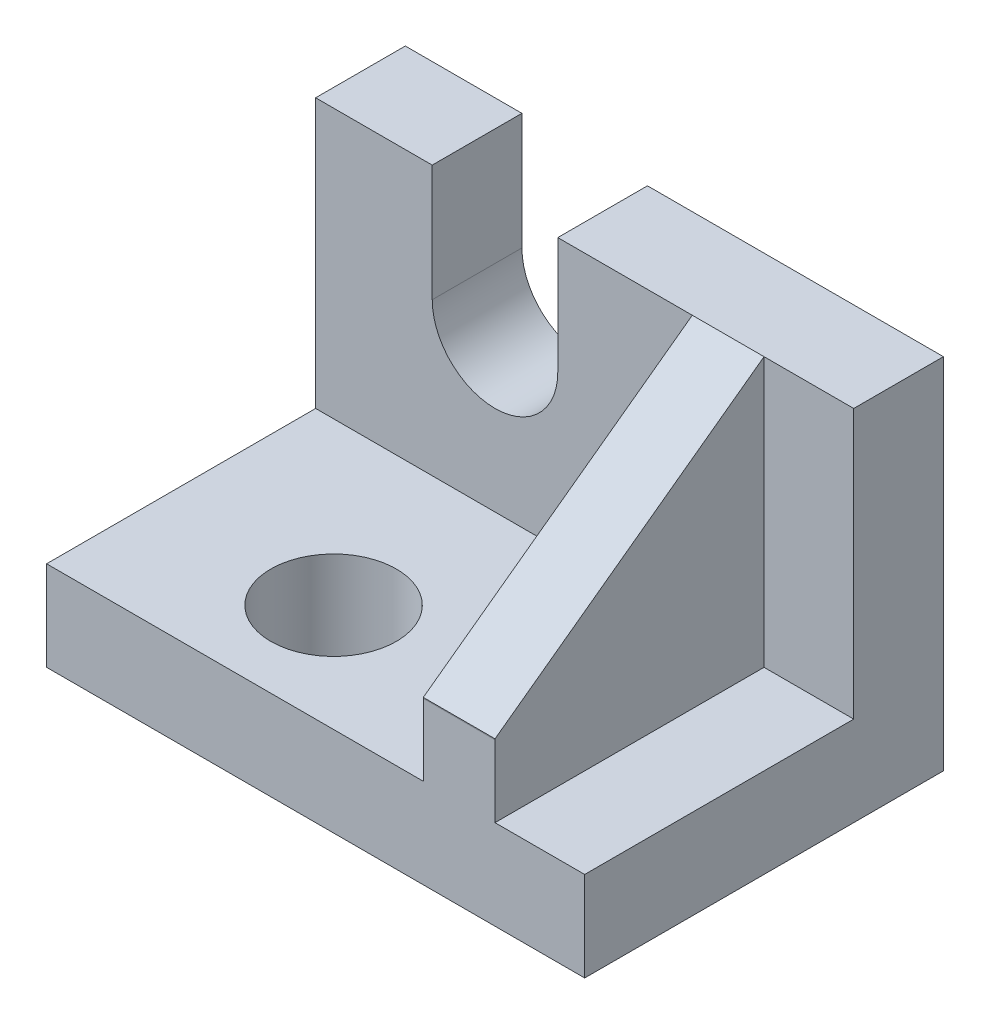
ISO-10303-21;
HEADER;
FILE_DESCRIPTION(('STEP AP214'),'2;1');
FILE_NAME('part.step','',(''),(''),'','','');
FILE_SCHEMA(('AUTOMOTIVE_DESIGN { 1 0 10303 214 1 1 1 1 }'));
ENDSEC;
DATA;
#1=APPLICATION_CONTEXT('core data for automotive mechanical design processes');
#2=APPLICATION_PROTOCOL_DEFINITION('international standard','automotive_design',2000,#1);
#3=PRODUCT_CONTEXT('',#1,'mechanical');
#4=PRODUCT('Part','Part','',(#3));
#5=PRODUCT_RELATED_PRODUCT_CATEGORY('part','',(#4));
#6=PRODUCT_DEFINITION_FORMATION('','',#4);
#7=PRODUCT_DEFINITION_CONTEXT('part definition',#1,'design');
#8=PRODUCT_DEFINITION('design','',#6,#7);
#9=PRODUCT_DEFINITION_SHAPE('','',#8);
#10=(LENGTH_UNIT() NAMED_UNIT(*) SI_UNIT(.MILLI.,.METRE.));
#11=(NAMED_UNIT(*) PLANE_ANGLE_UNIT() SI_UNIT($,.RADIAN.));
#12=(NAMED_UNIT(*) SI_UNIT($,.STERADIAN.) SOLID_ANGLE_UNIT());
#13=UNCERTAINTY_MEASURE_WITH_UNIT(LENGTH_MEASURE(1.E-05),#10,'distance_accuracy_value','');
#14=(GEOMETRIC_REPRESENTATION_CONTEXT(3) GLOBAL_UNCERTAINTY_ASSIGNED_CONTEXT((#13)) GLOBAL_UNIT_ASSIGNED_CONTEXT((#10,
#11,#12)) REPRESENTATION_CONTEXT('',''));
#15=CARTESIAN_POINT('',(0.,0.,0.));
#16=DIRECTION('',(0.,0.,1.));
#17=DIRECTION('',(1.,0.,0.));
#18=AXIS2_PLACEMENT_3D('',#15,#16,#17);
#19=CARTESIAN_POINT('',(0.,40.,0.));
#20=DIRECTION('',(0.,-1.,0.));
#21=DIRECTION('',(0.,0.,-1.));
#22=AXIS2_PLACEMENT_3D('',#19,#20,#21);
#23=PLANE('',#22);
#24=DIRECTION('',(0.,0.,1.));
#25=VECTOR('',#24,1.);
#26=CARTESIAN_POINT('',(-18.,40.,9.9999));
#27=LINE('',#26,#25);
#28=CARTESIAN_POINT('',(-18.,40.,9.9999));
#29=VERTEX_POINT('',#28);
#30=CARTESIAN_POINT('',(-18.,40.,10.));
#31=VERTEX_POINT('',#30);
#32=EDGE_CURVE('E226',#29,#31,#27,.T.);
#33=ORIENTED_EDGE('',*,*,#32,.T.);
#34=DIRECTION('',(1.,0.,0.));
#35=VECTOR('',#34,1.);
#36=CARTESIAN_POINT('',(-34.,40.,10.));
#37=LINE('',#36,#35);
#38=CARTESIAN_POINT('',(-9.99999999999999,40.,10.));
#39=VERTEX_POINT('',#38);
#40=EDGE_CURVE('E147',#31,#39,#37,.T.);
#41=ORIENTED_EDGE('',*,*,#40,.T.);
#42=DIRECTION('',(-1.,0.,0.));
#43=VECTOR('',#42,1.);
#44=CARTESIAN_POINT('',(0.,40.,10.));
#45=LINE('',#44,#43);
#46=CARTESIAN_POINT('',(0.,40.,10.));
#47=VERTEX_POINT('',#46);
#48=EDGE_CURVE('E192',#47,#39,#45,.T.);
#49=ORIENTED_EDGE('',*,*,#48,.F.);
#50=DIRECTION('',(0.,0.,-1.));
#51=VECTOR('',#50,1.);
#52=CARTESIAN_POINT('',(0.,40.,0.));
#53=LINE('',#52,#51);
#54=CARTESIAN_POINT('',(0.,40.,0.));
#55=VERTEX_POINT('',#54);
#56=EDGE_CURVE('E230',#47,#55,#53,.T.);
#57=ORIENTED_EDGE('',*,*,#56,.T.);
#58=DIRECTION('',(-1.,0.,0.));
#59=VECTOR('',#58,1.);
#60=CARTESIAN_POINT('',(0.,40.,0.));
#61=LINE('',#60,#59);
#62=CARTESIAN_POINT('',(-33.,40.,0.));
#63=VERTEX_POINT('',#62);
#64=EDGE_CURVE('E234',#55,#63,#61,.T.);
#65=ORIENTED_EDGE('',*,*,#64,.T.);
#66=DIRECTION('',(0.,0.,1.));
#67=VECTOR('',#66,1.);
#68=CARTESIAN_POINT('',(-33.,40.,-24.));
#69=LINE('',#68,#67);
#70=CARTESIAN_POINT('',(-33.,40.,9.9999));
#71=VERTEX_POINT('',#70);
#72=EDGE_CURVE('E175',#63,#71,#69,.T.);
#73=ORIENTED_EDGE('',*,*,#72,.T.);
#74=DIRECTION('',(1.,0.,0.));
#75=VECTOR('',#74,1.);
#76=CARTESIAN_POINT('',(-33.,40.,9.9999));
#77=LINE('',#76,#75);
#78=EDGE_CURVE('E204',#71,#29,#77,.T.);
#79=ORIENTED_EDGE('',*,*,#78,.T.);
#80=EDGE_LOOP('',(#33,#41,#49,#57,#65,#73,#79));
#81=FACE_BOUND('',#80,.T.);
#82=ADVANCED_FACE('F35',(#81),#23,.F.);
#83=DIRECTION('',(1.,0.,0.));
#84=VECTOR('',#83,1.);
#85=CARTESIAN_POINT('',(-60.,40.,9.9999));
#86=LINE('',#85,#84);
#87=CARTESIAN_POINT('',(-60.,40.,9.9999));
#88=VERTEX_POINT('',#87);
#89=CARTESIAN_POINT('',(-47.,40.,9.9999));
#90=VERTEX_POINT('',#89);
#91=EDGE_CURVE('E214',#88,#90,#86,.T.);
#92=ORIENTED_EDGE('',*,*,#91,.T.);
#93=DIRECTION('',(0.,0.,1.));
#94=VECTOR('',#93,1.);
#95=CARTESIAN_POINT('',(-47.,40.,-24.));
#96=LINE('',#95,#94);
#97=CARTESIAN_POINT('',(-47.,40.,0.));
#98=VERTEX_POINT('',#97);
#99=EDGE_CURVE('E174',#98,#90,#96,.T.);
#100=ORIENTED_EDGE('',*,*,#99,.F.);
#101=CARTESIAN_POINT('',(-60.,40.,0.));
#102=VERTEX_POINT('',#101);
#103=EDGE_CURVE('E232',#98,#102,#61,.T.);
#104=ORIENTED_EDGE('',*,*,#103,.T.);
#105=DIRECTION('',(0.,0.,1.));
#106=VECTOR('',#105,1.);
#107=CARTESIAN_POINT('',(-60.,40.,0.));
#108=LINE('',#107,#106);
#109=EDGE_CURVE('E237',#102,#88,#108,.T.);
#110=ORIENTED_EDGE('',*,*,#109,.T.);
#111=EDGE_LOOP('',(#92,#100,#104,#110));
#112=FACE_BOUND('',#111,.T.);
#113=ADVANCED_FACE('F314',(#112),#23,.F.);
#114=CARTESIAN_POINT('',(0.,40.,40.));
#115=DIRECTION('',(0.,0.,-1.));
#116=DIRECTION('',(-1.,0.,0.));
#117=AXIS2_PLACEMENT_3D('',#114,#115,#116);
#118=PLANE('',#117);
#119=DIRECTION('',(0.,-1.,0.));
#120=VECTOR('',#119,1.);
#121=CARTESIAN_POINT('',(-9.99999999999999,40.,40.));
#122=LINE('',#121,#120);
#123=CARTESIAN_POINT('',(-9.99999999999999,18.,40.));
#124=VERTEX_POINT('',#123);
#125=CARTESIAN_POINT('',(-9.99999999999999,10.,40.));
#126=VERTEX_POINT('',#125);
#127=EDGE_CURVE('E202',#124,#126,#122,.T.);
#128=ORIENTED_EDGE('',*,*,#127,.F.);
#129=DIRECTION('',(1.,0.,0.));
#130=VECTOR('',#129,1.);
#131=CARTESIAN_POINT('',(-34.,18.,40.));
#132=LINE('',#131,#130);
#133=CARTESIAN_POINT('',(-18.,18.,40.));
#134=VERTEX_POINT('',#133);
#135=EDGE_CURVE('E276',#134,#124,#132,.T.);
#136=ORIENTED_EDGE('',*,*,#135,.F.);
#137=DIRECTION('',(0.,1.,0.));
#138=VECTOR('',#137,1.);
#139=CARTESIAN_POINT('',(-18.,40.,40.));
#140=LINE('',#139,#138);
#141=CARTESIAN_POINT('',(-18.,10.,40.));
#142=VERTEX_POINT('',#141);
#143=EDGE_CURVE('E164',#142,#134,#140,.T.);
#144=ORIENTED_EDGE('',*,*,#143,.F.);
#145=DIRECTION('',(1.,0.,0.));
#146=VECTOR('',#145,1.);
#147=CARTESIAN_POINT('',(0.,10.,40.));
#148=LINE('',#147,#146);
#149=CARTESIAN_POINT('',(-60.,10.,40.));
#150=VERTEX_POINT('',#149);
#151=EDGE_CURVE('E259',#150,#142,#148,.T.);
#152=ORIENTED_EDGE('',*,*,#151,.F.);
#153=DIRECTION('',(0.,-1.,0.));
#154=VECTOR('',#153,1.);
#155=CARTESIAN_POINT('',(-60.,40.,40.));
#156=LINE('',#155,#154);
#157=CARTESIAN_POINT('',(-60.,0.,40.));
#158=VERTEX_POINT('',#157);
#159=EDGE_CURVE('E251',#150,#158,#156,.T.);
#160=ORIENTED_EDGE('',*,*,#159,.T.);
#161=DIRECTION('',(1.,0.,0.));
#162=VECTOR('',#161,1.);
#163=CARTESIAN_POINT('',(0.,0.,40.));
#164=LINE('',#163,#162);
#165=CARTESIAN_POINT('',(0.,0.,40.));
#166=VERTEX_POINT('',#165);
#167=EDGE_CURVE('E233',#158,#166,#164,.T.);
#168=ORIENTED_EDGE('',*,*,#167,.T.);
#169=DIRECTION('',(0.,-1.,0.));
#170=VECTOR('',#169,1.);
#171=CARTESIAN_POINT('',(0.,40.,40.));
#172=LINE('',#171,#170);
#173=CARTESIAN_POINT('',(0.,10.,40.));
#174=VERTEX_POINT('',#173);
#175=EDGE_CURVE('E240',#174,#166,#172,.T.);
#176=ORIENTED_EDGE('',*,*,#175,.F.);
#177=DIRECTION('',(1.,0.,0.));
#178=VECTOR('',#177,1.);
#179=CARTESIAN_POINT('',(0.,10.,40.));
#180=LINE('',#179,#178);
#181=EDGE_CURVE('E200',#126,#174,#180,.T.);
#182=ORIENTED_EDGE('',*,*,#181,.F.);
#183=EDGE_LOOP('',(#128,#136,#144,#152,#160,#168,#176,#182));
#184=FACE_BOUND('',#183,.T.);
#185=ADVANCED_FACE('F284',(#184),#118,.F.);
#186=CARTESIAN_POINT('',(0.,40.,0.));
#187=DIRECTION('',(-1.,0.,0.));
#188=DIRECTION('',(0.,0.,1.));
#189=AXIS2_PLACEMENT_3D('',#186,#187,#188);
#190=PLANE('',#189);
#191=DIRECTION('',(0.,0.,-1.));
#192=VECTOR('',#191,1.);
#193=CARTESIAN_POINT('',(0.,10.,0.));
#194=LINE('',#193,#192);
#195=CARTESIAN_POINT('',(0.,10.,10.));
#196=VERTEX_POINT('',#195);
#197=EDGE_CURVE('E44',#174,#196,#194,.T.);
#198=ORIENTED_EDGE('',*,*,#197,.F.);
#199=ORIENTED_EDGE('',*,*,#175,.T.);
#200=DIRECTION('',(0.,0.,-1.));
#201=VECTOR('',#200,1.);
#202=CARTESIAN_POINT('',(0.,0.,0.));
#203=LINE('',#202,#201);
#204=CARTESIAN_POINT('',(0.,0.,0.));
#205=VERTEX_POINT('',#204);
#206=EDGE_CURVE('E229',#166,#205,#203,.T.);
#207=ORIENTED_EDGE('',*,*,#206,.T.);
#208=DIRECTION('',(0.,-1.,0.));
#209=VECTOR('',#208,1.);
#210=CARTESIAN_POINT('',(0.,40.,0.));
#211=LINE('',#210,#209);
#212=EDGE_CURVE('E256',#55,#205,#211,.T.);
#213=ORIENTED_EDGE('',*,*,#212,.F.);
#214=ORIENTED_EDGE('',*,*,#56,.F.);
#215=DIRECTION('',(0.,1.,0.));
#216=VECTOR('',#215,1.);
#217=CARTESIAN_POINT('',(0.,10.,10.));
#218=LINE('',#217,#216);
#219=EDGE_CURVE('E190',#196,#47,#218,.T.);
#220=ORIENTED_EDGE('',*,*,#219,.F.);
#221=EDGE_LOOP('',(#198,#199,#207,#213,#214,#220));
#222=FACE_BOUND('',#221,.T.);
#223=ADVANCED_FACE('F37',(#222),#190,.F.);
#224=CARTESIAN_POINT('',(-60.,40.,0.));
#225=DIRECTION('',(1.,0.,0.));
#226=DIRECTION('',(0.,0.,-1.));
#227=AXIS2_PLACEMENT_3D('',#224,#225,#226);
#228=PLANE('',#227);
#229=DIRECTION('',(0.,0.,1.));
#230=VECTOR('',#229,1.);
#231=CARTESIAN_POINT('',(-60.,10.,9.9999));
#232=LINE('',#231,#230);
#233=CARTESIAN_POINT('',(-60.,10.,9.9999));
#234=VERTEX_POINT('',#233);
#235=EDGE_CURVE('E222',#234,#150,#232,.T.);
#236=ORIENTED_EDGE('',*,*,#235,.F.);
#237=DIRECTION('',(0.,1.,0.));
#238=VECTOR('',#237,1.);
#239=CARTESIAN_POINT('',(-60.,10.,9.9999));
#240=LINE('',#239,#238);
#241=EDGE_CURVE('E211',#234,#88,#240,.T.);
#242=ORIENTED_EDGE('',*,*,#241,.T.);
#243=ORIENTED_EDGE('',*,*,#109,.F.);
#244=DIRECTION('',(0.,-1.,0.));
#245=VECTOR('',#244,1.);
#246=CARTESIAN_POINT('',(-60.,40.,0.));
#247=LINE('',#246,#245);
#248=CARTESIAN_POINT('',(-60.,0.,0.));
#249=VERTEX_POINT('',#248);
#250=EDGE_CURVE('E253',#102,#249,#247,.T.);
#251=ORIENTED_EDGE('',*,*,#250,.T.);
#252=DIRECTION('',(0.,0.,1.));
#253=VECTOR('',#252,1.);
#254=CARTESIAN_POINT('',(-60.,0.,0.));
#255=LINE('',#254,#253);
#256=EDGE_CURVE('E245',#249,#158,#255,.T.);
#257=ORIENTED_EDGE('',*,*,#256,.T.);
#258=ORIENTED_EDGE('',*,*,#159,.F.);
#259=EDGE_LOOP('',(#236,#242,#243,#251,#257,#258));
#260=FACE_BOUND('',#259,.T.);
#261=ADVANCED_FACE('F309',(#260),#228,.F.);
#262=CARTESIAN_POINT('',(0.,40.,0.));
#263=DIRECTION('',(0.,0.,1.));
#264=DIRECTION('',(1.,0.,0.));
#265=AXIS2_PLACEMENT_3D('',#262,#263,#264);
#266=PLANE('',#265);
#267=DIRECTION('',(0.,-1.,0.));
#268=VECTOR('',#267,1.);
#269=CARTESIAN_POINT('',(-47.,40.,0.));
#270=LINE('',#269,#268);
#271=CARTESIAN_POINT('',(-47.,27.,0.));
#272=VERTEX_POINT('',#271);
#273=EDGE_CURVE('E178',#98,#272,#270,.T.);
#274=ORIENTED_EDGE('',*,*,#273,.T.);
#275=CARTESIAN_POINT('',(-40.,27.,0.));
#276=DIRECTION('',(0.,0.,1.));
#277=DIRECTION('',(1.,0.,0.));
#278=AXIS2_PLACEMENT_3D('',#275,#276,#277);
#279=CIRCLE('',#278,7.);
#280=CARTESIAN_POINT('',(-33.,27.,0.));
#281=VERTEX_POINT('',#280);
#282=EDGE_CURVE('E168',#272,#281,#279,.T.);
#283=ORIENTED_EDGE('',*,*,#282,.T.);
#284=DIRECTION('',(0.,1.,0.));
#285=VECTOR('',#284,1.);
#286=CARTESIAN_POINT('',(-33.,40.,0.));
#287=LINE('',#286,#285);
#288=EDGE_CURVE('E187',#281,#63,#287,.T.);
#289=ORIENTED_EDGE('',*,*,#288,.T.);
#290=ORIENTED_EDGE('',*,*,#64,.F.);
#291=ORIENTED_EDGE('',*,*,#212,.T.);
#292=DIRECTION('',(-1.,0.,0.));
#293=VECTOR('',#292,1.);
#294=CARTESIAN_POINT('',(0.,0.,0.));
#295=LINE('',#294,#293);
#296=EDGE_CURVE('E243',#205,#249,#295,.T.);
#297=ORIENTED_EDGE('',*,*,#296,.T.);
#298=ORIENTED_EDGE('',*,*,#250,.F.);
#299=ORIENTED_EDGE('',*,*,#103,.F.);
#300=EDGE_LOOP('',(#274,#283,#289,#290,#291,#297,#298,#299));
#301=FACE_BOUND('',#300,.T.);
#302=ADVANCED_FACE('F292',(#301),#266,.F.);
#303=CARTESIAN_POINT('',(0.,0.,0.));
#304=DIRECTION('',(0.,-1.,0.));
#305=DIRECTION('',(0.,0.,-1.));
#306=AXIS2_PLACEMENT_3D('',#303,#304,#305);
#307=PLANE('',#306);
#308=CARTESIAN_POINT('',(-40.,0.,28.));
#309=DIRECTION('',(0.,1.,0.));
#310=DIRECTION('',(0.,0.,1.));
#311=AXIS2_PLACEMENT_3D('',#308,#309,#310);
#312=CIRCLE('',#311,7.);
#313=CARTESIAN_POINT('',(-40.,0.,35.));
#314=VERTEX_POINT('',#313);
#315=EDGE_CURVE('E480',#314,#314,#312,.T.);
#316=ORIENTED_EDGE('',*,*,#315,.T.);
#317=EDGE_LOOP('',(#316));
#318=FACE_BOUND('',#317,.T.);
#319=ORIENTED_EDGE('',*,*,#206,.F.);
#320=ORIENTED_EDGE('',*,*,#167,.F.);
#321=ORIENTED_EDGE('',*,*,#256,.F.);
#322=ORIENTED_EDGE('',*,*,#296,.F.);
#323=EDGE_LOOP('',(#319,#320,#321,#322));
#324=FACE_BOUND('',#323,.T.);
#325=ADVANCED_FACE('F288',(#318,#324),#307,.T.);
#326=CARTESIAN_POINT('',(-18.,10.,9.9999));
#327=DIRECTION('',(0.,1.,0.));
#328=DIRECTION('',(0.,0.,1.));
#329=AXIS2_PLACEMENT_3D('',#326,#327,#328);
#330=PLANE('',#329);
#331=CARTESIAN_POINT('',(-40.,10.,28.));
#332=DIRECTION('',(0.,1.,0.));
#333=DIRECTION('',(0.,0.,1.));
#334=AXIS2_PLACEMENT_3D('',#331,#332,#333);
#335=CIRCLE('',#334,7.);
#336=CARTESIAN_POINT('',(-40.,10.,35.));
#337=VERTEX_POINT('',#336);
#338=EDGE_CURVE('E39',#337,#337,#335,.F.);
#339=ORIENTED_EDGE('',*,*,#338,.T.);
#340=EDGE_LOOP('',(#339));
#341=FACE_BOUND('',#340,.T.);
#342=ORIENTED_EDGE('',*,*,#151,.T.);
#343=DIRECTION('',(0.,0.,1.));
#344=VECTOR('',#343,1.);
#345=CARTESIAN_POINT('',(-18.,10.,9.9999));
#346=LINE('',#345,#344);
#347=CARTESIAN_POINT('',(-18.,10.,9.9999));
#348=VERTEX_POINT('',#347);
#349=EDGE_CURVE('E224',#348,#142,#346,.T.);
#350=ORIENTED_EDGE('',*,*,#349,.F.);
#351=DIRECTION('',(-1.,0.,0.));
#352=VECTOR('',#351,1.);
#353=CARTESIAN_POINT('',(-18.,10.,9.9999));
#354=LINE('',#353,#352);
#355=EDGE_CURVE('E209',#348,#234,#354,.T.);
#356=ORIENTED_EDGE('',*,*,#355,.T.);
#357=ORIENTED_EDGE('',*,*,#235,.T.);
#358=EDGE_LOOP('',(#342,#350,#356,#357));
#359=FACE_BOUND('',#358,.T.);
#360=ADVANCED_FACE('F304',(#341,#359),#330,.T.);
#361=CARTESIAN_POINT('',(-18.,40.,9.9999));
#362=DIRECTION('',(-1.,0.,0.));
#363=DIRECTION('',(0.,0.,1.));
#364=AXIS2_PLACEMENT_3D('',#361,#362,#363);
#365=PLANE('',#364);
#366=DIRECTION('',(0.,-0.999790885462355,0.0204495805922869));
#367=VECTOR('',#366,1.);
#368=CARTESIAN_POINT('',(-18.,40.6041610955405,39.5376577034602));
#369=LINE('',#368,#367);
#370=CARTESIAN_POINT('',(-18.,18.0983508013881,39.9979883466948));
#371=VERTEX_POINT('',#370);
#372=EDGE_CURVE('E151',#371,#134,#369,.T.);
#373=ORIENTED_EDGE('',*,*,#372,.F.);
#374=DIRECTION('',(0.,-0.589666260352129,0.807647015349116));
#375=VECTOR('',#374,1.);
#376=CARTESIAN_POINT('',(-18.,40.0000476242195,9.99993477062986));
#377=LINE('',#376,#375);
#378=EDGE_CURVE('E144',#31,#371,#377,.T.);
#379=ORIENTED_EDGE('',*,*,#378,.F.);
#380=ORIENTED_EDGE('',*,*,#32,.F.);
#381=DIRECTION('',(0.,-1.,0.));
#382=VECTOR('',#381,1.);
#383=CARTESIAN_POINT('',(-18.,40.,9.9999));
#384=LINE('',#383,#382);
#385=EDGE_CURVE('E207',#29,#348,#384,.T.);
#386=ORIENTED_EDGE('',*,*,#385,.T.);
#387=ORIENTED_EDGE('',*,*,#349,.T.);
#388=ORIENTED_EDGE('',*,*,#143,.T.);
#389=EDGE_LOOP('',(#373,#379,#380,#386,#387,#388));
#390=FACE_BOUND('',#389,.T.);
#391=ADVANCED_FACE('F161',(#390),#365,.T.);
#392=CARTESIAN_POINT('',(0.,0.,9.9999));
#393=DIRECTION('',(0.,0.,-1.));
#394=DIRECTION('',(-1.,0.,0.));
#395=AXIS2_PLACEMENT_3D('',#392,#393,#394);
#396=PLANE('',#395);
#397=DIRECTION('',(0.,1.,0.));
#398=VECTOR('',#397,1.);
#399=CARTESIAN_POINT('',(-33.,27.,9.9999));
#400=LINE('',#399,#398);
#401=CARTESIAN_POINT('',(-33.,27.,9.9999));
#402=VERTEX_POINT('',#401);
#403=EDGE_CURVE('E220',#402,#71,#400,.T.);
#404=ORIENTED_EDGE('',*,*,#403,.F.);
#405=CARTESIAN_POINT('',(-40.,27.,9.9999));
#406=DIRECTION('',(0.,0.,-1.));
#407=DIRECTION('',(-1.,0.,0.));
#408=AXIS2_PLACEMENT_3D('',#405,#406,#407);
#409=CIRCLE('',#408,7.);
#410=CARTESIAN_POINT('',(-47.,27.,9.9999));
#411=VERTEX_POINT('',#410);
#412=EDGE_CURVE('E165',#402,#411,#409,.T.);
#413=ORIENTED_EDGE('',*,*,#412,.T.);
#414=DIRECTION('',(0.,-1.,0.));
#415=VECTOR('',#414,1.);
#416=CARTESIAN_POINT('',(-47.,40.,9.9999));
#417=LINE('',#416,#415);
#418=EDGE_CURVE('E217',#90,#411,#417,.T.);
#419=ORIENTED_EDGE('',*,*,#418,.F.);
#420=ORIENTED_EDGE('',*,*,#91,.F.);
#421=ORIENTED_EDGE('',*,*,#241,.F.);
#422=ORIENTED_EDGE('',*,*,#355,.F.);
#423=ORIENTED_EDGE('',*,*,#385,.F.);
#424=ORIENTED_EDGE('',*,*,#78,.F.);
#425=EDGE_LOOP('',(#404,#413,#419,#420,#421,#422,#423,#424));
#426=FACE_BOUND('',#425,.T.);
#427=ADVANCED_FACE('F299',(#426),#396,.F.);
#428=CARTESIAN_POINT('',(-9.99999999999999,40.,53.));
#429=DIRECTION('',(1.,0.,0.));
#430=DIRECTION('',(0.,0.,-1.));
#431=AXIS2_PLACEMENT_3D('',#428,#429,#430);
#432=PLANE('',#431);
#433=DIRECTION('',(0.,0.999790885462355,-0.0204495805922869));
#434=VECTOR('',#433,1.);
#435=CARTESIAN_POINT('',(-9.99999999999999,39.7250109666391,39.5556397151739));
#436=LINE('',#435,#434);
#437=CARTESIAN_POINT('',(-9.99999999999999,18.0983508013881,39.9979883466948));
#438=VERTEX_POINT('',#437);
#439=EDGE_CURVE('E11',#124,#438,#436,.T.);
#440=ORIENTED_EDGE('',*,*,#439,.F.);
#441=ORIENTED_EDGE('',*,*,#127,.T.);
#442=DIRECTION('',(0.,0.,-1.));
#443=VECTOR('',#442,1.);
#444=CARTESIAN_POINT('',(-9.99999999999999,10.,53.));
#445=LINE('',#444,#443);
#446=CARTESIAN_POINT('',(-9.99999999999999,10.,10.));
#447=VERTEX_POINT('',#446);
#448=EDGE_CURVE('E198',#126,#447,#445,.T.);
#449=ORIENTED_EDGE('',*,*,#448,.T.);
#450=DIRECTION('',(0.,-1.,0.));
#451=VECTOR('',#450,1.);
#452=CARTESIAN_POINT('',(-9.99999999999999,40.,10.));
#453=LINE('',#452,#451);
#454=EDGE_CURVE('E195',#39,#447,#453,.T.);
#455=ORIENTED_EDGE('',*,*,#454,.F.);
#456=DIRECTION('',(0.,0.589666260352129,-0.807647015349116));
#457=VECTOR('',#456,1.);
#458=CARTESIAN_POINT('',(-9.99999999999999,19.5215856053047,38.0486291603004));
#459=LINE('',#458,#457);
#460=EDGE_CURVE('E152',#438,#39,#459,.T.);
#461=ORIENTED_EDGE('',*,*,#460,.F.);
#462=EDGE_LOOP('',(#440,#441,#449,#455,#461));
#463=FACE_BOUND('',#462,.T.);
#464=ADVANCED_FACE('F281',(#463),#432,.T.);
#465=CARTESIAN_POINT('',(-9.99999999999999,10.,53.));
#466=DIRECTION('',(0.,1.,0.));
#467=DIRECTION('',(0.,0.,1.));
#468=AXIS2_PLACEMENT_3D('',#465,#466,#467);
#469=PLANE('',#468);
#470=ORIENTED_EDGE('',*,*,#181,.T.);
#471=ORIENTED_EDGE('',*,*,#197,.T.);
#472=DIRECTION('',(1.,0.,0.));
#473=VECTOR('',#472,1.);
#474=CARTESIAN_POINT('',(-9.99999999999999,10.,10.));
#475=LINE('',#474,#473);
#476=EDGE_CURVE('E58',#447,#196,#475,.T.);
#477=ORIENTED_EDGE('',*,*,#476,.F.);
#478=ORIENTED_EDGE('',*,*,#448,.F.);
#479=EDGE_LOOP('',(#470,#471,#477,#478));
#480=FACE_BOUND('',#479,.T.);
#481=ADVANCED_FACE('F264',(#480),#469,.T.);
#482=CARTESIAN_POINT('',(0.,0.,10.));
#483=DIRECTION('',(0.,0.,1.));
#484=DIRECTION('',(1.,0.,0.));
#485=AXIS2_PLACEMENT_3D('',#482,#483,#484);
#486=PLANE('',#485);
#487=ORIENTED_EDGE('',*,*,#219,.T.);
#488=ORIENTED_EDGE('',*,*,#48,.T.);
#489=ORIENTED_EDGE('',*,*,#454,.T.);
#490=ORIENTED_EDGE('',*,*,#476,.T.);
#491=EDGE_LOOP('',(#487,#488,#489,#490));
#492=FACE_BOUND('',#491,.T.);
#493=ADVANCED_FACE('F272',(#492),#486,.T.);
#494=CARTESIAN_POINT('',(-33.,27.,-24.));
#495=DIRECTION('',(1.,0.,0.));
#496=DIRECTION('',(0.,0.,-1.));
#497=AXIS2_PLACEMENT_3D('',#494,#495,#496);
#498=PLANE('',#497);
#499=DIRECTION('',(0.,0.,1.));
#500=VECTOR('',#499,1.);
#501=CARTESIAN_POINT('',(-33.,27.,-24.));
#502=LINE('',#501,#500);
#503=EDGE_CURVE('E179',#281,#402,#502,.T.);
#504=ORIENTED_EDGE('',*,*,#503,.T.);
#505=ORIENTED_EDGE('',*,*,#403,.T.);
#506=ORIENTED_EDGE('',*,*,#72,.F.);
#507=ORIENTED_EDGE('',*,*,#288,.F.);
#508=EDGE_LOOP('',(#504,#505,#506,#507));
#509=FACE_BOUND('',#508,.T.);
#510=ADVANCED_FACE('F321',(#509),#498,.F.);
#511=CARTESIAN_POINT('',(-47.,40.,-24.));
#512=DIRECTION('',(-1.,0.,0.));
#513=DIRECTION('',(0.,0.,1.));
#514=AXIS2_PLACEMENT_3D('',#511,#512,#513);
#515=PLANE('',#514);
#516=ORIENTED_EDGE('',*,*,#99,.T.);
#517=ORIENTED_EDGE('',*,*,#418,.T.);
#518=DIRECTION('',(0.,0.,1.));
#519=VECTOR('',#518,1.);
#520=CARTESIAN_POINT('',(-47.,27.,-24.));
#521=LINE('',#520,#519);
#522=EDGE_CURVE('E182',#272,#411,#521,.T.);
#523=ORIENTED_EDGE('',*,*,#522,.F.);
#524=ORIENTED_EDGE('',*,*,#273,.F.);
#525=EDGE_LOOP('',(#516,#517,#523,#524));
#526=FACE_BOUND('',#525,.T.);
#527=ADVANCED_FACE('F317',(#526),#515,.F.);
#528=CARTESIAN_POINT('',(-40.,27.,-24.));
#529=DIRECTION('',(0.,0.,1.));
#530=DIRECTION('',(1.,0.,0.));
#531=AXIS2_PLACEMENT_3D('',#528,#529,#530);
#532=CYLINDRICAL_SURFACE('',#531,7.);
#533=ORIENTED_EDGE('',*,*,#522,.T.);
#534=ORIENTED_EDGE('',*,*,#412,.F.);
#535=ORIENTED_EDGE('',*,*,#503,.F.);
#536=ORIENTED_EDGE('',*,*,#282,.F.);
#537=EDGE_LOOP('',(#533,#534,#535,#536));
#538=FACE_BOUND('',#537,.T.);
#539=ADVANCED_FACE('F320',(#538),#532,.F.);
#540=CARTESIAN_POINT('',(-34.,18.,40.));
#541=DIRECTION('',(0.,-0.0204495805922869,-0.999790885462355));
#542=DIRECTION('',(0.,0.999790885462355,-0.0204495805922869));
#543=AXIS2_PLACEMENT_3D('',#540,#541,#542);
#544=PLANE('',#543);
#545=ORIENTED_EDGE('',*,*,#372,.T.);
#546=ORIENTED_EDGE('',*,*,#135,.T.);
#547=ORIENTED_EDGE('',*,*,#439,.T.);
#548=DIRECTION('',(1.,0.,0.));
#549=VECTOR('',#548,1.);
#550=CARTESIAN_POINT('',(-34.,18.0983508013881,39.9979883466948));
#551=LINE('',#550,#549);
#552=EDGE_CURVE('E51',#371,#438,#551,.T.);
#553=ORIENTED_EDGE('',*,*,#552,.F.);
#554=EDGE_LOOP('',(#545,#546,#547,#553));
#555=FACE_BOUND('',#554,.T.);
#556=ADVANCED_FACE('F155',(#555),#544,.F.);
#557=CARTESIAN_POINT('',(-34.,18.0983508013881,39.9979883466948));
#558=DIRECTION('',(0.,-0.807647015349116,-0.589666260352129));
#559=DIRECTION('',(0.,0.589666260352129,-0.807647015349116));
#560=AXIS2_PLACEMENT_3D('',#557,#558,#559);
#561=PLANE('',#560);
#562=ORIENTED_EDGE('',*,*,#378,.T.);
#563=ORIENTED_EDGE('',*,*,#552,.T.);
#564=ORIENTED_EDGE('',*,*,#460,.T.);
#565=ORIENTED_EDGE('',*,*,#40,.F.);
#566=EDGE_LOOP('',(#562,#563,#564,#565));
#567=FACE_BOUND('',#566,.T.);
#568=ADVANCED_FACE('F145',(#567),#561,.F.);
#569=CARTESIAN_POINT('',(-40.,37.,28.));
#570=DIRECTION('',(0.,-1.,0.));
#571=DIRECTION('',(0.,0.,-1.));
#572=AXIS2_PLACEMENT_3D('',#569,#570,#571);
#573=CYLINDRICAL_SURFACE('',#572,7.);
#574=ORIENTED_EDGE('',*,*,#338,.F.);
#575=EDGE_LOOP('',(#574));
#576=FACE_BOUND('',#575,.T.);
#577=ORIENTED_EDGE('',*,*,#315,.F.);
#578=EDGE_LOOP('',(#577));
#579=FACE_BOUND('',#578,.T.);
#580=ADVANCED_FACE('F411',(#576,#579),#573,.F.);
#581=CLOSED_SHELL('',(#82,#113,#185,#223,#261,#302,#325,#360,#391,#427,#464,#481,#493,#510,#527,
#539,#556,#568,#580));
#582=MANIFOLD_SOLID_BREP('B2',#581);
#583=ADVANCED_BREP_SHAPE_REPRESENTATION('',(#18,#582),#14);
#584=SHAPE_DEFINITION_REPRESENTATION(#9,#583);
ENDSEC;
END-ISO-10303-21;
